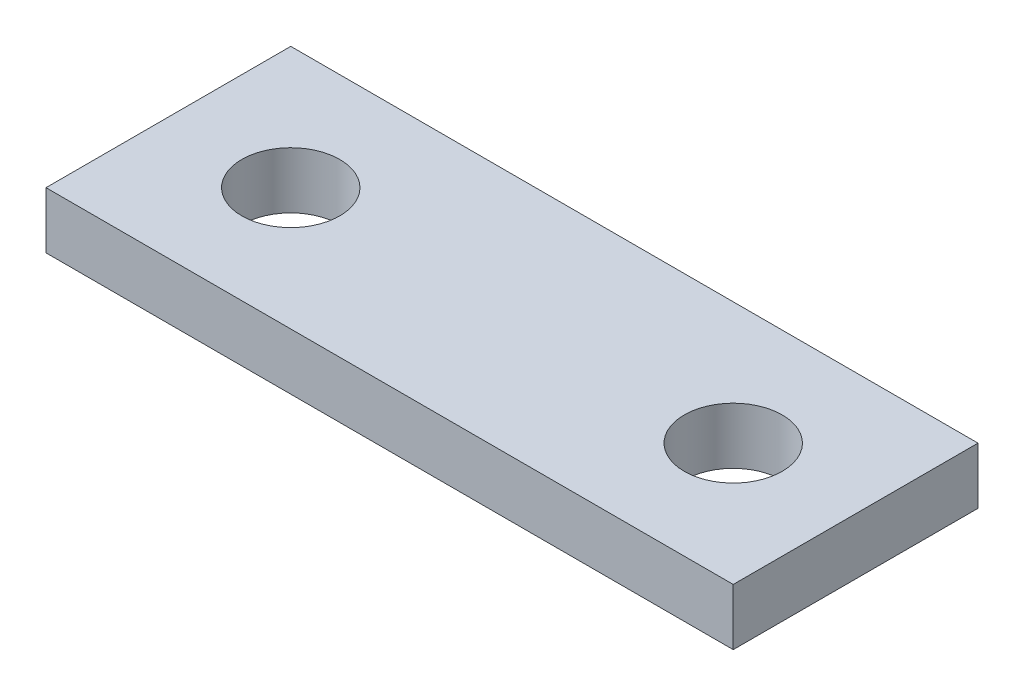
ISO-10303-21;
HEADER;
FILE_DESCRIPTION(('STEP AP214'),'2;1');
FILE_NAME('part.step','',(''),(''),'','','');
FILE_SCHEMA(('AUTOMOTIVE_DESIGN { 1 0 10303 214 1 1 1 1 }'));
ENDSEC;
DATA;
#1=APPLICATION_CONTEXT('core data for automotive mechanical design processes');
#2=APPLICATION_PROTOCOL_DEFINITION('international standard','automotive_design',2000,#1);
#3=PRODUCT_CONTEXT('',#1,'mechanical');
#4=PRODUCT('Part','Part','',(#3));
#5=PRODUCT_RELATED_PRODUCT_CATEGORY('part','',(#4));
#6=PRODUCT_DEFINITION_FORMATION('','',#4);
#7=PRODUCT_DEFINITION_CONTEXT('part definition',#1,'design');
#8=PRODUCT_DEFINITION('design','',#6,#7);
#9=PRODUCT_DEFINITION_SHAPE('','',#8);
#10=(LENGTH_UNIT() NAMED_UNIT(*) SI_UNIT(.MILLI.,.METRE.));
#11=(NAMED_UNIT(*) PLANE_ANGLE_UNIT() SI_UNIT($,.RADIAN.));
#12=(NAMED_UNIT(*) SI_UNIT($,.STERADIAN.) SOLID_ANGLE_UNIT());
#13=UNCERTAINTY_MEASURE_WITH_UNIT(LENGTH_MEASURE(1.E-05),#10,'distance_accuracy_value','');
#14=(GEOMETRIC_REPRESENTATION_CONTEXT(3) GLOBAL_UNCERTAINTY_ASSIGNED_CONTEXT((#13)) GLOBAL_UNIT_ASSIGNED_CONTEXT((#10,
#11,#12)) REPRESENTATION_CONTEXT('',''));
#15=CARTESIAN_POINT('',(0.,0.,0.));
#16=DIRECTION('',(0.,0.,1.));
#17=DIRECTION('',(1.,0.,0.));
#18=AXIS2_PLACEMENT_3D('',#15,#16,#17);
#19=CARTESIAN_POINT('',(0.,3.,0.));
#20=DIRECTION('',(0.,1.,0.));
#21=DIRECTION('',(0.,0.,1.));
#22=AXIS2_PLACEMENT_3D('',#19,#20,#21);
#23=PLANE('',#22);
#24=DIRECTION('',(1.,0.,0.));
#25=VECTOR('',#24,1.);
#26=CARTESIAN_POINT('',(0.,3.,0.));
#27=LINE('',#26,#25);
#28=CARTESIAN_POINT('',(-18.25,3.,0.));
#29=VERTEX_POINT('',#28);
#30=CARTESIAN_POINT('',(18.25,3.,0.));
#31=VERTEX_POINT('',#30);
#32=EDGE_CURVE('E111',#29,#31,#27,.T.);
#33=ORIENTED_EDGE('',*,*,#32,.T.);
#34=DIRECTION('',(0.,0.,1.));
#35=VECTOR('',#34,1.);
#36=CARTESIAN_POINT('',(18.25,3.,0.));
#37=LINE('',#36,#35);
#38=CARTESIAN_POINT('',(18.25,3.,-13.));
#39=VERTEX_POINT('',#38);
#40=EDGE_CURVE('E89',#39,#31,#37,.T.);
#41=ORIENTED_EDGE('',*,*,#40,.F.);
#42=DIRECTION('',(-1.,0.,0.));
#43=VECTOR('',#42,1.);
#44=CARTESIAN_POINT('',(0.,3.,-13.));
#45=LINE('',#44,#43);
#46=CARTESIAN_POINT('',(-18.25,3.,-13.));
#47=VERTEX_POINT('',#46);
#48=EDGE_CURVE('E66',#39,#47,#45,.T.);
#49=ORIENTED_EDGE('',*,*,#48,.T.);
#50=DIRECTION('',(0.,0.,1.));
#51=VECTOR('',#50,1.);
#52=CARTESIAN_POINT('',(-18.25,3.,0.));
#53=LINE('',#52,#51);
#54=EDGE_CURVE('E50',#47,#29,#53,.T.);
#55=ORIENTED_EDGE('',*,*,#54,.T.);
#56=EDGE_LOOP('',(#33,#41,#49,#55));
#57=FACE_BOUND('',#56,.T.);
#58=CARTESIAN_POINT('',(-11.75,3.,-6.5));
#59=DIRECTION('',(0.,1.,0.));
#60=DIRECTION('',(0.,0.,1.));
#61=AXIS2_PLACEMENT_3D('',#58,#59,#60);
#62=CIRCLE('',#61,2.6);
#63=CARTESIAN_POINT('',(-11.75,3.,-3.9));
#64=VERTEX_POINT('',#63);
#65=EDGE_CURVE('E82',#64,#64,#62,.T.);
#66=ORIENTED_EDGE('',*,*,#65,.F.);
#67=EDGE_LOOP('',(#66));
#68=FACE_BOUND('',#67,.T.);
#69=CARTESIAN_POINT('',(11.75,3.,-6.5));
#70=DIRECTION('',(0.,-1.,0.));
#71=DIRECTION('',(0.,0.,1.));
#72=AXIS2_PLACEMENT_3D('',#69,#70,#71);
#73=CIRCLE('',#72,2.6);
#74=CARTESIAN_POINT('',(11.75,3.,-3.9));
#75=VERTEX_POINT('',#74);
#76=EDGE_CURVE('E94',#75,#75,#73,.T.);
#77=ORIENTED_EDGE('',*,*,#76,.T.);
#78=EDGE_LOOP('',(#77));
#79=FACE_BOUND('',#78,.T.);
#80=ADVANCED_FACE('F33',(#57,#68,#79),#23,.T.);
#81=CARTESIAN_POINT('',(0.,0.,0.));
#82=DIRECTION('',(0.,1.,0.));
#83=DIRECTION('',(0.,0.,1.));
#84=AXIS2_PLACEMENT_3D('',#81,#82,#83);
#85=PLANE('',#84);
#86=DIRECTION('',(-1.,0.,0.));
#87=VECTOR('',#86,1.);
#88=CARTESIAN_POINT('',(0.,0.,-13.));
#89=LINE('',#88,#87);
#90=CARTESIAN_POINT('',(18.25,0.,-13.));
#91=VERTEX_POINT('',#90);
#92=CARTESIAN_POINT('',(-18.25,0.,-13.));
#93=VERTEX_POINT('',#92);
#94=EDGE_CURVE('E61',#91,#93,#89,.T.);
#95=ORIENTED_EDGE('',*,*,#94,.F.);
#96=DIRECTION('',(0.,0.,1.));
#97=VECTOR('',#96,1.);
#98=CARTESIAN_POINT('',(18.25,0.,0.));
#99=LINE('',#98,#97);
#100=CARTESIAN_POINT('',(18.25,0.,0.));
#101=VERTEX_POINT('',#100);
#102=EDGE_CURVE('E80',#91,#101,#99,.T.);
#103=ORIENTED_EDGE('',*,*,#102,.T.);
#104=DIRECTION('',(1.,0.,0.));
#105=VECTOR('',#104,1.);
#106=CARTESIAN_POINT('',(0.,0.,0.));
#107=LINE('',#106,#105);
#108=CARTESIAN_POINT('',(-18.25,0.,0.));
#109=VERTEX_POINT('',#108);
#110=EDGE_CURVE('E109',#109,#101,#107,.T.);
#111=ORIENTED_EDGE('',*,*,#110,.F.);
#112=DIRECTION('',(0.,0.,1.));
#113=VECTOR('',#112,1.);
#114=CARTESIAN_POINT('',(-18.25,0.,0.));
#115=LINE('',#114,#113);
#116=EDGE_CURVE('E81',#93,#109,#115,.T.);
#117=ORIENTED_EDGE('',*,*,#116,.F.);
#118=EDGE_LOOP('',(#95,#103,#111,#117));
#119=FACE_BOUND('',#118,.T.);
#120=CARTESIAN_POINT('',(-11.75,0.,-6.5));
#121=DIRECTION('',(0.,1.,0.));
#122=DIRECTION('',(0.,0.,1.));
#123=AXIS2_PLACEMENT_3D('',#120,#121,#122);
#124=CIRCLE('',#123,2.6);
#125=CARTESIAN_POINT('',(-11.75,0.,-3.9));
#126=VERTEX_POINT('',#125);
#127=EDGE_CURVE('E103',#126,#126,#124,.T.);
#128=ORIENTED_EDGE('',*,*,#127,.T.);
#129=EDGE_LOOP('',(#128));
#130=FACE_BOUND('',#129,.T.);
#131=CARTESIAN_POINT('',(11.75,0.,-6.5));
#132=DIRECTION('',(0.,-1.,0.));
#133=DIRECTION('',(0.,0.,1.));
#134=AXIS2_PLACEMENT_3D('',#131,#132,#133);
#135=CIRCLE('',#134,2.6);
#136=CARTESIAN_POINT('',(11.75,0.,-3.9));
#137=VERTEX_POINT('',#136);
#138=EDGE_CURVE('E98',#137,#137,#135,.T.);
#139=ORIENTED_EDGE('',*,*,#138,.F.);
#140=EDGE_LOOP('',(#139));
#141=FACE_BOUND('',#140,.T.);
#142=ADVANCED_FACE('F76',(#119,#130,#141),#85,.F.);
#143=CARTESIAN_POINT('',(0.,3.,-13.));
#144=DIRECTION('',(0.,0.,1.));
#145=DIRECTION('',(1.,0.,0.));
#146=AXIS2_PLACEMENT_3D('',#143,#144,#145);
#147=PLANE('',#146);
#148=ORIENTED_EDGE('',*,*,#94,.T.);
#149=DIRECTION('',(0.,-1.,0.));
#150=VECTOR('',#149,1.);
#151=CARTESIAN_POINT('',(-18.25,3.,-13.));
#152=LINE('',#151,#150);
#153=EDGE_CURVE('E11',#47,#93,#152,.T.);
#154=ORIENTED_EDGE('',*,*,#153,.F.);
#155=ORIENTED_EDGE('',*,*,#48,.F.);
#156=DIRECTION('',(0.,-1.,0.));
#157=VECTOR('',#156,1.);
#158=CARTESIAN_POINT('',(18.25,3.,-13.));
#159=LINE('',#158,#157);
#160=EDGE_CURVE('E84',#39,#91,#159,.T.);
#161=ORIENTED_EDGE('',*,*,#160,.T.);
#162=EDGE_LOOP('',(#148,#154,#155,#161));
#163=FACE_BOUND('',#162,.T.);
#164=ADVANCED_FACE('F35',(#163),#147,.F.);
#165=CARTESIAN_POINT('',(-18.25,3.,0.));
#166=DIRECTION('',(1.,0.,0.));
#167=DIRECTION('',(0.,0.,-1.));
#168=AXIS2_PLACEMENT_3D('',#165,#166,#167);
#169=PLANE('',#168);
#170=ORIENTED_EDGE('',*,*,#116,.T.);
#171=DIRECTION('',(0.,-1.,0.));
#172=VECTOR('',#171,1.);
#173=CARTESIAN_POINT('',(-18.25,3.,0.));
#174=LINE('',#173,#172);
#175=EDGE_CURVE('E42',#29,#109,#174,.T.);
#176=ORIENTED_EDGE('',*,*,#175,.F.);
#177=ORIENTED_EDGE('',*,*,#54,.F.);
#178=ORIENTED_EDGE('',*,*,#153,.T.);
#179=EDGE_LOOP('',(#170,#176,#177,#178));
#180=FACE_BOUND('',#179,.T.);
#181=ADVANCED_FACE('F119',(#180),#169,.F.);
#182=CARTESIAN_POINT('',(0.,3.,0.));
#183=DIRECTION('',(0.,0.,-1.));
#184=DIRECTION('',(-1.,0.,0.));
#185=AXIS2_PLACEMENT_3D('',#182,#183,#184);
#186=PLANE('',#185);
#187=ORIENTED_EDGE('',*,*,#110,.T.);
#188=DIRECTION('',(0.,-1.,0.));
#189=VECTOR('',#188,1.);
#190=CARTESIAN_POINT('',(18.25,3.,0.));
#191=LINE('',#190,#189);
#192=EDGE_CURVE('E88',#31,#101,#191,.T.);
#193=ORIENTED_EDGE('',*,*,#192,.F.);
#194=ORIENTED_EDGE('',*,*,#32,.F.);
#195=ORIENTED_EDGE('',*,*,#175,.T.);
#196=EDGE_LOOP('',(#187,#193,#194,#195));
#197=FACE_BOUND('',#196,.T.);
#198=ADVANCED_FACE('F117',(#197),#186,.F.);
#199=CARTESIAN_POINT('',(-11.75,3.,-6.5));
#200=DIRECTION('',(0.,-1.,0.));
#201=DIRECTION('',(0.,0.,-1.));
#202=AXIS2_PLACEMENT_3D('',#199,#200,#201);
#203=CYLINDRICAL_SURFACE('',#202,2.6);
#204=ORIENTED_EDGE('',*,*,#65,.T.);
#205=EDGE_LOOP('',(#204));
#206=FACE_BOUND('',#205,.T.);
#207=ORIENTED_EDGE('',*,*,#127,.F.);
#208=EDGE_LOOP('',(#207));
#209=FACE_BOUND('',#208,.T.);
#210=ADVANCED_FACE('F125',(#206,#209),#203,.F.);
#211=CARTESIAN_POINT('',(18.25,3.,0.));
#212=DIRECTION('',(1.,0.,0.));
#213=DIRECTION('',(0.,0.,-1.));
#214=AXIS2_PLACEMENT_3D('',#211,#212,#213);
#215=PLANE('',#214);
#216=ORIENTED_EDGE('',*,*,#102,.F.);
#217=ORIENTED_EDGE('',*,*,#160,.F.);
#218=ORIENTED_EDGE('',*,*,#40,.T.);
#219=ORIENTED_EDGE('',*,*,#192,.T.);
#220=EDGE_LOOP('',(#216,#217,#218,#219));
#221=FACE_BOUND('',#220,.T.);
#222=ADVANCED_FACE('F92',(#221),#215,.T.);
#223=CARTESIAN_POINT('',(11.75,3.,-6.5));
#224=DIRECTION('',(0.,-1.,0.));
#225=DIRECTION('',(0.,0.,-1.));
#226=AXIS2_PLACEMENT_3D('',#223,#224,#225);
#227=CYLINDRICAL_SURFACE('',#226,2.6);
#228=ORIENTED_EDGE('',*,*,#76,.F.);
#229=EDGE_LOOP('',(#228));
#230=FACE_BOUND('',#229,.T.);
#231=ORIENTED_EDGE('',*,*,#138,.T.);
#232=EDGE_LOOP('',(#231));
#233=FACE_BOUND('',#232,.T.);
#234=ADVANCED_FACE('F140',(#230,#233),#227,.F.);
#235=CLOSED_SHELL('',(#80,#142,#164,#181,#198,#210,#222,#234));
#236=MANIFOLD_SOLID_BREP('B2',#235);
#237=ADVANCED_BREP_SHAPE_REPRESENTATION('',(#18,#236),#14);
#238=SHAPE_DEFINITION_REPRESENTATION(#9,#237);
ENDSEC;
END-ISO-10303-21;
